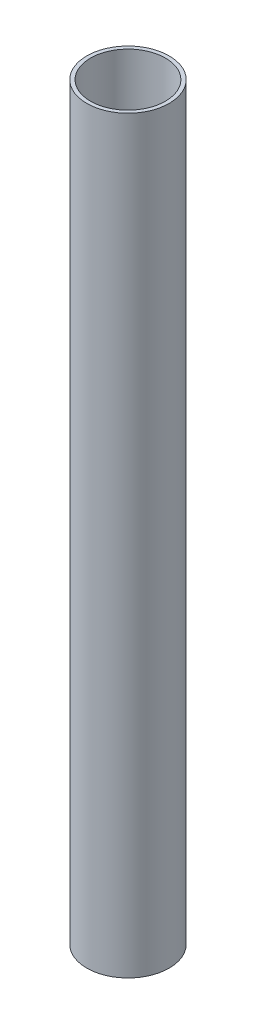
ISO-10303-21;
HEADER;
FILE_DESCRIPTION(('STEP AP214'),'2;1');
FILE_NAME('part.step','',(''),(''),'','','');
FILE_SCHEMA(('AUTOMOTIVE_DESIGN { 1 0 10303 214 1 1 1 1 }'));
ENDSEC;
DATA;
#1=APPLICATION_CONTEXT('core data for automotive mechanical design processes');
#2=APPLICATION_PROTOCOL_DEFINITION('international standard','automotive_design',2000,#1);
#3=PRODUCT_CONTEXT('',#1,'mechanical');
#4=PRODUCT('Part','Part','',(#3));
#5=PRODUCT_RELATED_PRODUCT_CATEGORY('part','',(#4));
#6=PRODUCT_DEFINITION_FORMATION('','',#4);
#7=PRODUCT_DEFINITION_CONTEXT('part definition',#1,'design');
#8=PRODUCT_DEFINITION('design','',#6,#7);
#9=PRODUCT_DEFINITION_SHAPE('','',#8);
#10=(LENGTH_UNIT() NAMED_UNIT(*) SI_UNIT(.MILLI.,.METRE.));
#11=(NAMED_UNIT(*) PLANE_ANGLE_UNIT() SI_UNIT($,.RADIAN.));
#12=(NAMED_UNIT(*) SI_UNIT($,.STERADIAN.) SOLID_ANGLE_UNIT());
#13=UNCERTAINTY_MEASURE_WITH_UNIT(LENGTH_MEASURE(1.E-05),#10,'distance_accuracy_value','');
#14=(GEOMETRIC_REPRESENTATION_CONTEXT(3) GLOBAL_UNCERTAINTY_ASSIGNED_CONTEXT((#13)) GLOBAL_UNIT_ASSIGNED_CONTEXT((#10,
#11,#12)) REPRESENTATION_CONTEXT('',''));
#15=CARTESIAN_POINT('',(0.,0.,0.));
#16=DIRECTION('',(0.,0.,1.));
#17=DIRECTION('',(1.,0.,0.));
#18=AXIS2_PLACEMENT_3D('',#15,#16,#17);
#19=CARTESIAN_POINT('',(0.,1000.,0.));
#20=DIRECTION('',(0.,1.,0.));
#21=DIRECTION('',(0.,0.,1.));
#22=AXIS2_PLACEMENT_3D('',#19,#20,#21);
#23=PLANE('',#22);
#24=CARTESIAN_POINT('',(0.,1000.,0.));
#25=DIRECTION('',(0.,1.,0.));
#26=DIRECTION('',(0.,0.,1.));
#27=AXIS2_PLACEMENT_3D('',#24,#25,#26);
#28=CIRCLE('',#27,55.);
#29=CARTESIAN_POINT('',(0.,1000.,55.));
#30=VERTEX_POINT('',#29);
#31=EDGE_CURVE('E10',#30,#30,#28,.T.);
#32=ORIENTED_EDGE('',*,*,#31,.T.);
#33=EDGE_LOOP('',(#32));
#34=FACE_BOUND('',#33,.T.);
#35=CARTESIAN_POINT('',(0.,1000.,0.));
#36=DIRECTION('',(0.,1.,0.));
#37=DIRECTION('',(0.,0.,1.));
#38=AXIS2_PLACEMENT_3D('',#35,#36,#37);
#39=CIRCLE('',#38,50.);
#40=CARTESIAN_POINT('',(0.,1000.,50.));
#41=VERTEX_POINT('',#40);
#42=EDGE_CURVE('E43',#41,#41,#39,.T.);
#43=ORIENTED_EDGE('',*,*,#42,.F.);
#44=EDGE_LOOP('',(#43));
#45=FACE_BOUND('',#44,.T.);
#46=ADVANCED_FACE('F32',(#34,#45),#23,.T.);
#47=CARTESIAN_POINT('',(0.,0.,0.));
#48=DIRECTION('',(0.,1.,0.));
#49=DIRECTION('',(0.,0.,1.));
#50=AXIS2_PLACEMENT_3D('',#47,#48,#49);
#51=PLANE('',#50);
#52=CARTESIAN_POINT('',(0.,0.,0.));
#53=DIRECTION('',(0.,1.,0.));
#54=DIRECTION('',(0.,0.,1.));
#55=AXIS2_PLACEMENT_3D('',#52,#53,#54);
#56=CIRCLE('',#55,55.);
#57=CARTESIAN_POINT('',(0.,0.,55.));
#58=VERTEX_POINT('',#57);
#59=EDGE_CURVE('E36',#58,#58,#56,.T.);
#60=ORIENTED_EDGE('',*,*,#59,.F.);
#61=EDGE_LOOP('',(#60));
#62=FACE_BOUND('',#61,.T.);
#63=CARTESIAN_POINT('',(0.,0.,0.));
#64=DIRECTION('',(0.,1.,0.));
#65=DIRECTION('',(0.,0.,1.));
#66=AXIS2_PLACEMENT_3D('',#63,#64,#65);
#67=CIRCLE('',#66,50.);
#68=CARTESIAN_POINT('',(0.,0.,50.));
#69=VERTEX_POINT('',#68);
#70=EDGE_CURVE('E45',#69,#69,#67,.T.);
#71=ORIENTED_EDGE('',*,*,#70,.T.);
#72=EDGE_LOOP('',(#71));
#73=FACE_BOUND('',#72,.T.);
#74=ADVANCED_FACE('F55',(#62,#73),#51,.F.);
#75=CARTESIAN_POINT('',(0.,1000.,0.));
#76=DIRECTION('',(0.,-1.,0.));
#77=DIRECTION('',(0.,0.,-1.));
#78=AXIS2_PLACEMENT_3D('',#75,#76,#77);
#79=CYLINDRICAL_SURFACE('',#78,55.);
#80=ORIENTED_EDGE('',*,*,#31,.F.);
#81=EDGE_LOOP('',(#80));
#82=FACE_BOUND('',#81,.T.);
#83=ORIENTED_EDGE('',*,*,#59,.T.);
#84=EDGE_LOOP('',(#83));
#85=FACE_BOUND('',#84,.T.);
#86=ADVANCED_FACE('F34',(#82,#85),#79,.T.);
#87=CARTESIAN_POINT('',(0.,1000.,0.));
#88=DIRECTION('',(0.,-1.,0.));
#89=DIRECTION('',(0.,0.,-1.));
#90=AXIS2_PLACEMENT_3D('',#87,#88,#89);
#91=CYLINDRICAL_SURFACE('',#90,50.);
#92=ORIENTED_EDGE('',*,*,#42,.T.);
#93=EDGE_LOOP('',(#92));
#94=FACE_BOUND('',#93,.T.);
#95=ORIENTED_EDGE('',*,*,#70,.F.);
#96=EDGE_LOOP('',(#95));
#97=FACE_BOUND('',#96,.T.);
#98=ADVANCED_FACE('F51',(#94,#97),#91,.F.);
#99=CLOSED_SHELL('',(#46,#74,#86,#98));
#100=MANIFOLD_SOLID_BREP('B2',#99);
#101=ADVANCED_BREP_SHAPE_REPRESENTATION('',(#18,#100),#14);
#102=SHAPE_DEFINITION_REPRESENTATION(#9,#101);
ENDSEC;
END-ISO-10303-21;
